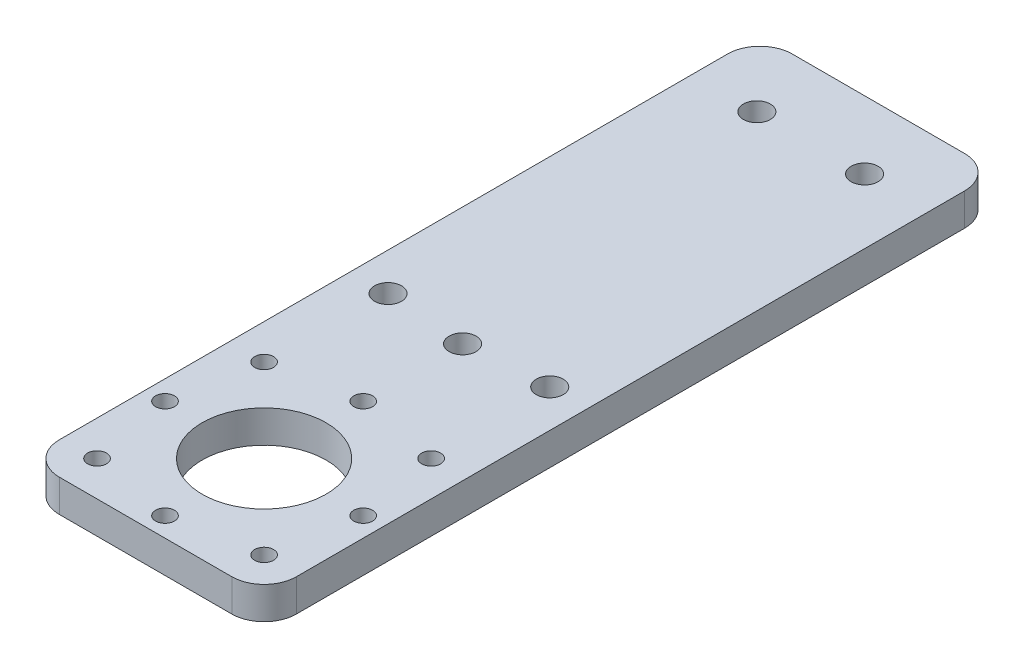
ISO-10303-21;
HEADER;
FILE_DESCRIPTION(('STEP AP214'),'2;1');
FILE_NAME('part.step','',(''),(''),'','','');
FILE_SCHEMA(('AUTOMOTIVE_DESIGN { 1 0 10303 214 1 1 1 1 }'));
ENDSEC;
DATA;
#1=APPLICATION_CONTEXT('core data for automotive mechanical design processes');
#2=APPLICATION_PROTOCOL_DEFINITION('international standard','automotive_design',2000,#1);
#3=PRODUCT_CONTEXT('',#1,'mechanical');
#4=PRODUCT('Part','Part','',(#3));
#5=PRODUCT_RELATED_PRODUCT_CATEGORY('part','',(#4));
#6=PRODUCT_DEFINITION_FORMATION('','',#4);
#7=PRODUCT_DEFINITION_CONTEXT('part definition',#1,'design');
#8=PRODUCT_DEFINITION('design','',#6,#7);
#9=PRODUCT_DEFINITION_SHAPE('','',#8);
#10=(LENGTH_UNIT() NAMED_UNIT(*) SI_UNIT(.MILLI.,.METRE.));
#11=(NAMED_UNIT(*) PLANE_ANGLE_UNIT() SI_UNIT($,.RADIAN.));
#12=(NAMED_UNIT(*) SI_UNIT($,.STERADIAN.) SOLID_ANGLE_UNIT());
#13=UNCERTAINTY_MEASURE_WITH_UNIT(LENGTH_MEASURE(1.E-05),#10,'distance_accuracy_value','');
#14=(GEOMETRIC_REPRESENTATION_CONTEXT(3) GLOBAL_UNCERTAINTY_ASSIGNED_CONTEXT((#13)) GLOBAL_UNIT_ASSIGNED_CONTEXT((#10,
#11,#12)) REPRESENTATION_CONTEXT('',''));
#15=CARTESIAN_POINT('',(0.,0.,0.));
#16=DIRECTION('',(0.,0.,1.));
#17=DIRECTION('',(1.,0.,0.));
#18=AXIS2_PLACEMENT_3D('',#15,#16,#17);
#19=CARTESIAN_POINT('',(0.,0.,0.));
#20=DIRECTION('',(0.,1.,0.));
#21=DIRECTION('',(0.,0.,1.));
#22=AXIS2_PLACEMENT_3D('',#19,#20,#21);
#23=PLANE('',#22);
#24=CARTESIAN_POINT('',(18.38477631085,0.,0.));
#25=DIRECTION('',(0.,-1.,0.));
#26=DIRECTION('',(0.,0.,-1.));
#27=AXIS2_PLACEMENT_3D('',#24,#25,#26);
#28=CIRCLE('',#27,1.75);
#29=CARTESIAN_POINT('',(18.38477631085,0.,-1.75));
#30=VERTEX_POINT('',#29);
#31=EDGE_CURVE('E211',#30,#30,#28,.F.);
#32=ORIENTED_EDGE('',*,*,#31,.T.);
#33=EDGE_LOOP('',(#32));
#34=FACE_BOUND('',#33,.T.);
#35=CARTESIAN_POINT('',(0.,0.,18.38477631085));
#36=DIRECTION('',(0.,-1.,0.));
#37=DIRECTION('',(0.,0.,-1.));
#38=AXIS2_PLACEMENT_3D('',#35,#36,#37);
#39=CIRCLE('',#38,1.75);
#40=CARTESIAN_POINT('',(0.,0.,16.63477631085));
#41=VERTEX_POINT('',#40);
#42=EDGE_CURVE('E215',#41,#41,#39,.F.);
#43=ORIENTED_EDGE('',*,*,#42,.T.);
#44=EDGE_LOOP('',(#43));
#45=FACE_BOUND('',#44,.T.);
#46=CARTESIAN_POINT('',(-18.38477631085,0.,0.));
#47=DIRECTION('',(0.,-1.,0.));
#48=DIRECTION('',(0.,0.,-1.));
#49=AXIS2_PLACEMENT_3D('',#46,#47,#48);
#50=CIRCLE('',#49,1.75);
#51=CARTESIAN_POINT('',(-18.38477631085,0.,-1.75));
#52=VERTEX_POINT('',#51);
#53=EDGE_CURVE('E219',#52,#52,#50,.F.);
#54=ORIENTED_EDGE('',*,*,#53,.T.);
#55=EDGE_LOOP('',(#54));
#56=FACE_BOUND('',#55,.T.);
#57=CARTESIAN_POINT('',(0.,0.,-18.38477631085));
#58=DIRECTION('',(0.,-1.,0.));
#59=DIRECTION('',(0.,0.,-1.));
#60=AXIS2_PLACEMENT_3D('',#57,#58,#59);
#61=CIRCLE('',#60,1.75);
#62=CARTESIAN_POINT('',(0.,0.,-20.13477631085));
#63=VERTEX_POINT('',#62);
#64=EDGE_CURVE('E223',#63,#63,#61,.F.);
#65=ORIENTED_EDGE('',*,*,#64,.T.);
#66=EDGE_LOOP('',(#65));
#67=FACE_BOUND('',#66,.T.);
#68=CARTESIAN_POINT('',(-15.5,0.,15.5));
#69=DIRECTION('',(0.,-1.,0.));
#70=DIRECTION('',(0.,0.,-1.));
#71=AXIS2_PLACEMENT_3D('',#68,#69,#70);
#72=CIRCLE('',#71,1.75);
#73=CARTESIAN_POINT('',(-15.5,0.,13.75));
#74=VERTEX_POINT('',#73);
#75=EDGE_CURVE('E227',#74,#74,#72,.F.);
#76=ORIENTED_EDGE('',*,*,#75,.T.);
#77=EDGE_LOOP('',(#76));
#78=FACE_BOUND('',#77,.T.);
#79=CARTESIAN_POINT('',(-15.5,0.,-15.5));
#80=DIRECTION('',(0.,-1.,0.));
#81=DIRECTION('',(0.,0.,-1.));
#82=AXIS2_PLACEMENT_3D('',#79,#80,#81);
#83=CIRCLE('',#82,1.75);
#84=CARTESIAN_POINT('',(-15.5,0.,-17.25));
#85=VERTEX_POINT('',#84);
#86=EDGE_CURVE('E231',#85,#85,#83,.F.);
#87=ORIENTED_EDGE('',*,*,#86,.T.);
#88=EDGE_LOOP('',(#87));
#89=FACE_BOUND('',#88,.T.);
#90=CARTESIAN_POINT('',(15.5,0.,-15.5));
#91=DIRECTION('',(0.,-1.,0.));
#92=DIRECTION('',(0.,0.,-1.));
#93=AXIS2_PLACEMENT_3D('',#90,#91,#92);
#94=CIRCLE('',#93,1.75);
#95=CARTESIAN_POINT('',(15.5,0.,-17.25));
#96=VERTEX_POINT('',#95);
#97=EDGE_CURVE('E235',#96,#96,#94,.F.);
#98=ORIENTED_EDGE('',*,*,#97,.T.);
#99=EDGE_LOOP('',(#98));
#100=FACE_BOUND('',#99,.T.);
#101=CARTESIAN_POINT('',(15.5,0.,15.5));
#102=DIRECTION('',(0.,-1.,0.));
#103=DIRECTION('',(0.,0.,-1.));
#104=AXIS2_PLACEMENT_3D('',#101,#102,#103);
#105=CIRCLE('',#104,1.75);
#106=CARTESIAN_POINT('',(15.5,0.,13.75));
#107=VERTEX_POINT('',#106);
#108=EDGE_CURVE('E239',#107,#107,#105,.F.);
#109=ORIENTED_EDGE('',*,*,#108,.T.);
#110=EDGE_LOOP('',(#109));
#111=FACE_BOUND('',#110,.T.);
#112=CARTESIAN_POINT('',(15.,0.,-38.));
#113=DIRECTION('',(0.,1.,0.));
#114=DIRECTION('',(0.,0.,1.));
#115=AXIS2_PLACEMENT_3D('',#112,#113,#114);
#116=CIRCLE('',#115,2.5);
#117=CARTESIAN_POINT('',(15.,0.,-35.5));
#118=VERTEX_POINT('',#117);
#119=EDGE_CURVE('E243',#118,#118,#116,.T.);
#120=ORIENTED_EDGE('',*,*,#119,.T.);
#121=EDGE_LOOP('',(#120));
#122=FACE_BOUND('',#121,.T.);
#123=CARTESIAN_POINT('',(-15.,0.,-38.));
#124=DIRECTION('',(0.,1.,0.));
#125=DIRECTION('',(0.,0.,1.));
#126=AXIS2_PLACEMENT_3D('',#123,#124,#125);
#127=CIRCLE('',#126,2.5);
#128=CARTESIAN_POINT('',(-15.,0.,-35.5));
#129=VERTEX_POINT('',#128);
#130=EDGE_CURVE('E247',#129,#129,#127,.T.);
#131=ORIENTED_EDGE('',*,*,#130,.T.);
#132=EDGE_LOOP('',(#131));
#133=FACE_BOUND('',#132,.T.);
#134=CARTESIAN_POINT('',(-10.,0.,-101.43));
#135=DIRECTION('',(0.,-1.,0.));
#136=DIRECTION('',(0.,0.,-1.));
#137=AXIS2_PLACEMENT_3D('',#134,#135,#136);
#138=CIRCLE('',#137,2.5);
#139=CARTESIAN_POINT('',(-10.,0.,-103.93));
#140=VERTEX_POINT('',#139);
#141=EDGE_CURVE('E251',#140,#140,#138,.F.);
#142=ORIENTED_EDGE('',*,*,#141,.T.);
#143=EDGE_LOOP('',(#142));
#144=FACE_BOUND('',#143,.T.);
#145=CARTESIAN_POINT('',(0.,0.,0.));
#146=DIRECTION('',(0.,-1.,0.));
#147=DIRECTION('',(0.,0.,-1.));
#148=AXIS2_PLACEMENT_3D('',#145,#146,#147);
#149=CIRCLE('',#148,11.5);
#150=CARTESIAN_POINT('',(0.,0.,-11.5));
#151=VERTEX_POINT('',#150);
#152=EDGE_CURVE('E255',#151,#151,#149,.F.);
#153=ORIENTED_EDGE('',*,*,#152,.T.);
#154=EDGE_LOOP('',(#153));
#155=FACE_BOUND('',#154,.T.);
#156=CARTESIAN_POINT('',(10.,0.,-101.43));
#157=DIRECTION('',(0.,-1.,0.));
#158=DIRECTION('',(0.,0.,-1.));
#159=AXIS2_PLACEMENT_3D('',#156,#157,#158);
#160=CIRCLE('',#159,2.5);
#161=CARTESIAN_POINT('',(10.,0.,-103.93));
#162=VERTEX_POINT('',#161);
#163=EDGE_CURVE('E259',#162,#162,#160,.F.);
#164=ORIENTED_EDGE('',*,*,#163,.T.);
#165=EDGE_LOOP('',(#164));
#166=FACE_BOUND('',#165,.T.);
#167=CARTESIAN_POINT('',(0.,0.,-36.83));
#168=DIRECTION('',(0.,-1.,0.));
#169=DIRECTION('',(0.,0.,-1.));
#170=AXIS2_PLACEMENT_3D('',#167,#168,#169);
#171=CIRCLE('',#170,2.5);
#172=CARTESIAN_POINT('',(0.,0.,-39.33));
#173=VERTEX_POINT('',#172);
#174=EDGE_CURVE('E262',#173,#173,#171,.F.);
#175=ORIENTED_EDGE('',*,*,#174,.T.);
#176=EDGE_LOOP('',(#175));
#177=FACE_BOUND('',#176,.T.);
#178=CARTESIAN_POINT('',(-16.,0.,16.));
#179=DIRECTION('',(0.,-1.,0.));
#180=DIRECTION('',(0.,0.,-1.));
#181=AXIS2_PLACEMENT_3D('',#178,#179,#180);
#182=CIRCLE('',#181,6.);
#183=CARTESIAN_POINT('',(-22.,0.,16.));
#184=VERTEX_POINT('',#183);
#185=CARTESIAN_POINT('',(-16.,0.,22.));
#186=VERTEX_POINT('',#185);
#187=EDGE_CURVE('E270',#184,#186,#182,.F.);
#188=ORIENTED_EDGE('',*,*,#187,.F.);
#189=DIRECTION('',(0.,0.,1.));
#190=VECTOR('',#189,1.);
#191=CARTESIAN_POINT('',(-22.,0.,-114.));
#192=LINE('',#191,#190);
#193=CARTESIAN_POINT('',(-22.,0.,-108.));
#194=VERTEX_POINT('',#193);
#195=EDGE_CURVE('E138',#194,#184,#192,.T.);
#196=ORIENTED_EDGE('',*,*,#195,.F.);
#197=CARTESIAN_POINT('',(-16.,0.,-108.));
#198=DIRECTION('',(0.,-1.,0.));
#199=DIRECTION('',(0.,0.,-1.));
#200=AXIS2_PLACEMENT_3D('',#197,#198,#199);
#201=CIRCLE('',#200,6.);
#202=CARTESIAN_POINT('',(-16.,0.,-114.));
#203=VERTEX_POINT('',#202);
#204=EDGE_CURVE('E104',#203,#194,#201,.F.);
#205=ORIENTED_EDGE('',*,*,#204,.F.);
#206=DIRECTION('',(-1.,0.,0.));
#207=VECTOR('',#206,1.);
#208=CARTESIAN_POINT('',(22.,0.,-114.));
#209=LINE('',#208,#207);
#210=CARTESIAN_POINT('',(16.,0.,-114.));
#211=VERTEX_POINT('',#210);
#212=EDGE_CURVE('E99',#211,#203,#209,.T.);
#213=ORIENTED_EDGE('',*,*,#212,.F.);
#214=CARTESIAN_POINT('',(16.,0.,-108.));
#215=DIRECTION('',(0.,-1.,0.));
#216=DIRECTION('',(0.,0.,-1.));
#217=AXIS2_PLACEMENT_3D('',#214,#215,#216);
#218=CIRCLE('',#217,6.);
#219=CARTESIAN_POINT('',(22.,0.,-108.));
#220=VERTEX_POINT('',#219);
#221=EDGE_CURVE('E20',#220,#211,#218,.F.);
#222=ORIENTED_EDGE('',*,*,#221,.F.);
#223=DIRECTION('',(0.,0.,-1.));
#224=VECTOR('',#223,1.);
#225=CARTESIAN_POINT('',(22.,0.,22.));
#226=LINE('',#225,#224);
#227=CARTESIAN_POINT('',(22.,0.,16.));
#228=VERTEX_POINT('',#227);
#229=EDGE_CURVE('E93',#228,#220,#226,.T.);
#230=ORIENTED_EDGE('',*,*,#229,.F.);
#231=CARTESIAN_POINT('',(16.,0.,16.));
#232=DIRECTION('',(0.,-1.,0.));
#233=DIRECTION('',(0.,0.,-1.));
#234=AXIS2_PLACEMENT_3D('',#231,#232,#233);
#235=CIRCLE('',#234,6.);
#236=CARTESIAN_POINT('',(16.,0.,22.));
#237=VERTEX_POINT('',#236);
#238=EDGE_CURVE('E266',#237,#228,#235,.F.);
#239=ORIENTED_EDGE('',*,*,#238,.F.);
#240=DIRECTION('',(1.,0.,0.));
#241=VECTOR('',#240,1.);
#242=CARTESIAN_POINT('',(-22.,0.,22.));
#243=LINE('',#242,#241);
#244=EDGE_CURVE('E131',#186,#237,#243,.T.);
#245=ORIENTED_EDGE('',*,*,#244,.F.);
#246=EDGE_LOOP('',(#188,#196,#205,#213,#222,#230,#239,#245));
#247=FACE_BOUND('',#246,.T.);
#248=ADVANCED_FACE('F17',(#34,#45,#56,#67,#78,#89,#100,#111,#122,#133,#144,#155,#166,#177,#247),
#23,.F.);
#249=CARTESIAN_POINT('',(22.,0.,22.));
#250=DIRECTION('',(1.,0.,0.));
#251=DIRECTION('',(0.,0.,-1.));
#252=AXIS2_PLACEMENT_3D('',#249,#250,#251);
#253=PLANE('',#252);
#254=DIRECTION('',(0.,0.,1.));
#255=VECTOR('',#254,1.);
#256=CARTESIAN_POINT('',(22.,6.,0.));
#257=LINE('',#256,#255);
#258=CARTESIAN_POINT('',(22.,6.,16.));
#259=VERTEX_POINT('',#258);
#260=CARTESIAN_POINT('',(22.,6.,-108.));
#261=VERTEX_POINT('',#260);
#262=EDGE_CURVE('E210',#259,#261,#257,.F.);
#263=ORIENTED_EDGE('',*,*,#262,.F.);
#264=DIRECTION('',(0.,-1.,0.));
#265=VECTOR('',#264,1.);
#266=CARTESIAN_POINT('',(22.,13.8216,16.));
#267=LINE('',#266,#265);
#268=EDGE_CURVE('E134',#228,#259,#267,.F.);
#269=ORIENTED_EDGE('',*,*,#268,.F.);
#270=ORIENTED_EDGE('',*,*,#229,.T.);
#271=DIRECTION('',(0.,-1.,0.));
#272=VECTOR('',#271,1.);
#273=CARTESIAN_POINT('',(22.,13.8216,-108.));
#274=LINE('',#273,#272);
#275=EDGE_CURVE('E115',#261,#220,#274,.T.);
#276=ORIENTED_EDGE('',*,*,#275,.F.);
#277=EDGE_LOOP('',(#263,#269,#270,#276));
#278=FACE_BOUND('',#277,.T.);
#279=ADVANCED_FACE('F309',(#278),#253,.T.);
#280=CARTESIAN_POINT('',(16.,13.8216,-108.));
#281=DIRECTION('',(0.,-1.,0.));
#282=DIRECTION('',(0.,0.,-1.));
#283=AXIS2_PLACEMENT_3D('',#280,#281,#282);
#284=CYLINDRICAL_SURFACE('',#283,6.);
#285=ORIENTED_EDGE('',*,*,#275,.T.);
#286=ORIENTED_EDGE('',*,*,#221,.T.);
#287=DIRECTION('',(0.,1.,0.));
#288=VECTOR('',#287,1.);
#289=CARTESIAN_POINT('',(16.,0.,-114.));
#290=LINE('',#289,#288);
#291=CARTESIAN_POINT('',(16.,6.,-114.));
#292=VERTEX_POINT('',#291);
#293=EDGE_CURVE('E109',#292,#211,#290,.F.);
#294=ORIENTED_EDGE('',*,*,#293,.F.);
#295=CARTESIAN_POINT('',(16.,6.,-108.));
#296=DIRECTION('',(0.,-1.,0.));
#297=DIRECTION('',(0.,0.,-1.));
#298=AXIS2_PLACEMENT_3D('',#295,#296,#297);
#299=CIRCLE('',#298,6.);
#300=EDGE_CURVE('E207',#261,#292,#299,.F.);
#301=ORIENTED_EDGE('',*,*,#300,.F.);
#302=EDGE_LOOP('',(#285,#286,#294,#301));
#303=FACE_BOUND('',#302,.T.);
#304=ADVANCED_FACE('F112',(#303),#284,.T.);
#305=CARTESIAN_POINT('',(22.,0.,-114.));
#306=DIRECTION('',(0.,0.,-1.));
#307=DIRECTION('',(-1.,0.,0.));
#308=AXIS2_PLACEMENT_3D('',#305,#306,#307);
#309=PLANE('',#308);
#310=DIRECTION('',(1.,0.,0.));
#311=VECTOR('',#310,1.);
#312=CARTESIAN_POINT('',(0.,6.,-114.));
#313=LINE('',#312,#311);
#314=CARTESIAN_POINT('',(-16.,6.,-114.));
#315=VERTEX_POINT('',#314);
#316=EDGE_CURVE('E119',#292,#315,#313,.F.);
#317=ORIENTED_EDGE('',*,*,#316,.F.);
#318=ORIENTED_EDGE('',*,*,#293,.T.);
#319=ORIENTED_EDGE('',*,*,#212,.T.);
#320=DIRECTION('',(0.,-1.,0.));
#321=VECTOR('',#320,1.);
#322=CARTESIAN_POINT('',(-16.,13.8216,-114.));
#323=LINE('',#322,#321);
#324=EDGE_CURVE('E122',#315,#203,#323,.T.);
#325=ORIENTED_EDGE('',*,*,#324,.F.);
#326=EDGE_LOOP('',(#317,#318,#319,#325));
#327=FACE_BOUND('',#326,.T.);
#328=ADVANCED_FACE('F117',(#327),#309,.T.);
#329=CARTESIAN_POINT('',(-16.,13.8216,-108.));
#330=DIRECTION('',(0.,-1.,0.));
#331=DIRECTION('',(0.,0.,-1.));
#332=AXIS2_PLACEMENT_3D('',#329,#330,#331);
#333=CYLINDRICAL_SURFACE('',#332,6.);
#334=ORIENTED_EDGE('',*,*,#324,.T.);
#335=ORIENTED_EDGE('',*,*,#204,.T.);
#336=DIRECTION('',(0.,1.,0.));
#337=VECTOR('',#336,1.);
#338=CARTESIAN_POINT('',(-22.,0.,-108.));
#339=LINE('',#338,#337);
#340=CARTESIAN_POINT('',(-22.,6.,-108.));
#341=VERTEX_POINT('',#340);
#342=EDGE_CURVE('E141',#341,#194,#339,.F.);
#343=ORIENTED_EDGE('',*,*,#342,.F.);
#344=CARTESIAN_POINT('',(-16.,6.,-108.));
#345=DIRECTION('',(0.,-1.,0.));
#346=DIRECTION('',(0.,0.,-1.));
#347=AXIS2_PLACEMENT_3D('',#344,#345,#346);
#348=CIRCLE('',#347,6.);
#349=EDGE_CURVE('E203',#315,#341,#348,.F.);
#350=ORIENTED_EDGE('',*,*,#349,.F.);
#351=EDGE_LOOP('',(#334,#335,#343,#350));
#352=FACE_BOUND('',#351,.T.);
#353=ADVANCED_FACE('F311',(#352),#333,.T.);
#354=CARTESIAN_POINT('',(-22.,0.,-114.));
#355=DIRECTION('',(-1.,0.,0.));
#356=DIRECTION('',(0.,0.,1.));
#357=AXIS2_PLACEMENT_3D('',#354,#355,#356);
#358=PLANE('',#357);
#359=ORIENTED_EDGE('',*,*,#195,.T.);
#360=DIRECTION('',(0.,-1.,0.));
#361=VECTOR('',#360,1.);
#362=CARTESIAN_POINT('',(-22.,13.8216,16.));
#363=LINE('',#362,#361);
#364=CARTESIAN_POINT('',(-22.,6.,16.));
#365=VERTEX_POINT('',#364);
#366=EDGE_CURVE('E140',#365,#184,#363,.T.);
#367=ORIENTED_EDGE('',*,*,#366,.F.);
#368=DIRECTION('',(0.,0.,1.));
#369=VECTOR('',#368,1.);
#370=CARTESIAN_POINT('',(-22.,6.,0.));
#371=LINE('',#370,#369);
#372=EDGE_CURVE('E202',#341,#365,#371,.T.);
#373=ORIENTED_EDGE('',*,*,#372,.F.);
#374=ORIENTED_EDGE('',*,*,#342,.T.);
#375=EDGE_LOOP('',(#359,#367,#373,#374));
#376=FACE_BOUND('',#375,.T.);
#377=ADVANCED_FACE('F312',(#376),#358,.T.);
#378=CARTESIAN_POINT('',(-16.,13.8216,16.));
#379=DIRECTION('',(0.,-1.,0.));
#380=DIRECTION('',(0.,0.,-1.));
#381=AXIS2_PLACEMENT_3D('',#378,#379,#380);
#382=CYLINDRICAL_SURFACE('',#381,6.);
#383=ORIENTED_EDGE('',*,*,#366,.T.);
#384=ORIENTED_EDGE('',*,*,#187,.T.);
#385=DIRECTION('',(0.,1.,0.));
#386=VECTOR('',#385,1.);
#387=CARTESIAN_POINT('',(-16.,0.,22.));
#388=LINE('',#387,#386);
#389=CARTESIAN_POINT('',(-16.,6.,22.));
#390=VERTEX_POINT('',#389);
#391=EDGE_CURVE('E135',#390,#186,#388,.F.);
#392=ORIENTED_EDGE('',*,*,#391,.F.);
#393=CARTESIAN_POINT('',(-16.,6.,16.));
#394=DIRECTION('',(0.,-1.,0.));
#395=DIRECTION('',(0.,0.,-1.));
#396=AXIS2_PLACEMENT_3D('',#393,#394,#395);
#397=CIRCLE('',#396,6.);
#398=EDGE_CURVE('E198',#365,#390,#397,.F.);
#399=ORIENTED_EDGE('',*,*,#398,.F.);
#400=EDGE_LOOP('',(#383,#384,#392,#399));
#401=FACE_BOUND('',#400,.T.);
#402=ADVANCED_FACE('F306',(#401),#382,.T.);
#403=CARTESIAN_POINT('',(-22.,0.,22.));
#404=DIRECTION('',(0.,0.,1.));
#405=DIRECTION('',(1.,0.,0.));
#406=AXIS2_PLACEMENT_3D('',#403,#404,#405);
#407=PLANE('',#406);
#408=ORIENTED_EDGE('',*,*,#244,.T.);
#409=DIRECTION('',(0.,-1.,0.));
#410=VECTOR('',#409,1.);
#411=CARTESIAN_POINT('',(16.,13.8216,22.));
#412=LINE('',#411,#410);
#413=CARTESIAN_POINT('',(16.,6.,22.));
#414=VERTEX_POINT('',#413);
#415=EDGE_CURVE('E40',#414,#237,#412,.T.);
#416=ORIENTED_EDGE('',*,*,#415,.F.);
#417=DIRECTION('',(1.,0.,0.));
#418=VECTOR('',#417,1.);
#419=CARTESIAN_POINT('',(0.,6.,22.));
#420=LINE('',#419,#418);
#421=EDGE_CURVE('E197',#390,#414,#420,.T.);
#422=ORIENTED_EDGE('',*,*,#421,.F.);
#423=ORIENTED_EDGE('',*,*,#391,.T.);
#424=EDGE_LOOP('',(#408,#416,#422,#423));
#425=FACE_BOUND('',#424,.T.);
#426=ADVANCED_FACE('F302',(#425),#407,.T.);
#427=CARTESIAN_POINT('',(16.,13.8216,16.));
#428=DIRECTION('',(0.,-1.,0.));
#429=DIRECTION('',(0.,0.,-1.));
#430=AXIS2_PLACEMENT_3D('',#427,#428,#429);
#431=CYLINDRICAL_SURFACE('',#430,6.);
#432=ORIENTED_EDGE('',*,*,#415,.T.);
#433=ORIENTED_EDGE('',*,*,#238,.T.);
#434=ORIENTED_EDGE('',*,*,#268,.T.);
#435=CARTESIAN_POINT('',(16.,6.,16.));
#436=DIRECTION('',(0.,-1.,0.));
#437=DIRECTION('',(0.,0.,-1.));
#438=AXIS2_PLACEMENT_3D('',#435,#436,#437);
#439=CIRCLE('',#438,6.);
#440=EDGE_CURVE('E193',#414,#259,#439,.F.);
#441=ORIENTED_EDGE('',*,*,#440,.F.);
#442=EDGE_LOOP('',(#432,#433,#434,#441));
#443=FACE_BOUND('',#442,.T.);
#444=ADVANCED_FACE('F308',(#443),#431,.T.);
#445=CARTESIAN_POINT('',(0.,6.,-36.83));
#446=DIRECTION('',(0.,-1.,0.));
#447=DIRECTION('',(0.,0.,-1.));
#448=AXIS2_PLACEMENT_3D('',#445,#446,#447);
#449=CYLINDRICAL_SURFACE('',#448,2.5);
#450=CARTESIAN_POINT('',(0.,6.,-36.83));
#451=DIRECTION('',(0.,-1.,0.));
#452=DIRECTION('',(0.,0.,-1.));
#453=AXIS2_PLACEMENT_3D('',#450,#451,#452);
#454=CIRCLE('',#453,2.5);
#455=CARTESIAN_POINT('',(0.,6.,-39.33));
#456=VERTEX_POINT('',#455);
#457=EDGE_CURVE('E189',#456,#456,#454,.T.);
#458=ORIENTED_EDGE('',*,*,#457,.F.);
#459=EDGE_LOOP('',(#458));
#460=FACE_BOUND('',#459,.T.);
#461=ORIENTED_EDGE('',*,*,#174,.F.);
#462=EDGE_LOOP('',(#461));
#463=FACE_BOUND('',#462,.T.);
#464=ADVANCED_FACE('F380',(#460,#463),#449,.F.);
#465=CARTESIAN_POINT('',(10.,6.,-101.43));
#466=DIRECTION('',(0.,-1.,0.));
#467=DIRECTION('',(0.,0.,-1.));
#468=AXIS2_PLACEMENT_3D('',#465,#466,#467);
#469=CYLINDRICAL_SURFACE('',#468,2.5);
#470=CARTESIAN_POINT('',(10.,6.,-101.43));
#471=DIRECTION('',(0.,-1.,0.));
#472=DIRECTION('',(0.,0.,-1.));
#473=AXIS2_PLACEMENT_3D('',#470,#471,#472);
#474=CIRCLE('',#473,2.5);
#475=CARTESIAN_POINT('',(10.,6.,-103.93));
#476=VERTEX_POINT('',#475);
#477=EDGE_CURVE('E186',#476,#476,#474,.T.);
#478=ORIENTED_EDGE('',*,*,#477,.F.);
#479=EDGE_LOOP('',(#478));
#480=FACE_BOUND('',#479,.T.);
#481=ORIENTED_EDGE('',*,*,#163,.F.);
#482=EDGE_LOOP('',(#481));
#483=FACE_BOUND('',#482,.T.);
#484=ADVANCED_FACE('F376',(#480,#483),#469,.F.);
#485=CARTESIAN_POINT('',(0.,6.,0.));
#486=DIRECTION('',(0.,-1.,0.));
#487=DIRECTION('',(0.,0.,-1.));
#488=AXIS2_PLACEMENT_3D('',#485,#486,#487);
#489=CYLINDRICAL_SURFACE('',#488,11.5);
#490=CARTESIAN_POINT('',(0.,6.,0.));
#491=DIRECTION('',(0.,-1.,0.));
#492=DIRECTION('',(0.,0.,-1.));
#493=AXIS2_PLACEMENT_3D('',#490,#491,#492);
#494=CIRCLE('',#493,11.5);
#495=CARTESIAN_POINT('',(0.,6.,-11.5));
#496=VERTEX_POINT('',#495);
#497=EDGE_CURVE('E182',#496,#496,#494,.T.);
#498=ORIENTED_EDGE('',*,*,#497,.F.);
#499=EDGE_LOOP('',(#498));
#500=FACE_BOUND('',#499,.T.);
#501=ORIENTED_EDGE('',*,*,#152,.F.);
#502=EDGE_LOOP('',(#501));
#503=FACE_BOUND('',#502,.T.);
#504=ADVANCED_FACE('F372',(#500,#503),#489,.F.);
#505=CARTESIAN_POINT('',(-10.,6.,-101.43));
#506=DIRECTION('',(0.,-1.,0.));
#507=DIRECTION('',(0.,0.,-1.));
#508=AXIS2_PLACEMENT_3D('',#505,#506,#507);
#509=CYLINDRICAL_SURFACE('',#508,2.5);
#510=CARTESIAN_POINT('',(-10.,6.,-101.43));
#511=DIRECTION('',(0.,-1.,0.));
#512=DIRECTION('',(0.,0.,-1.));
#513=AXIS2_PLACEMENT_3D('',#510,#511,#512);
#514=CIRCLE('',#513,2.5);
#515=CARTESIAN_POINT('',(-10.,6.,-103.93));
#516=VERTEX_POINT('',#515);
#517=EDGE_CURVE('E178',#516,#516,#514,.T.);
#518=ORIENTED_EDGE('',*,*,#517,.F.);
#519=EDGE_LOOP('',(#518));
#520=FACE_BOUND('',#519,.T.);
#521=ORIENTED_EDGE('',*,*,#141,.F.);
#522=EDGE_LOOP('',(#521));
#523=FACE_BOUND('',#522,.T.);
#524=ADVANCED_FACE('F368',(#520,#523),#509,.F.);
#525=CARTESIAN_POINT('',(-15.,0.,-38.));
#526=DIRECTION('',(0.,1.,0.));
#527=DIRECTION('',(0.,0.,1.));
#528=AXIS2_PLACEMENT_3D('',#525,#526,#527);
#529=CYLINDRICAL_SURFACE('',#528,2.5);
#530=CARTESIAN_POINT('',(-15.,6.,-38.));
#531=DIRECTION('',(0.,1.,0.));
#532=DIRECTION('',(0.,0.,1.));
#533=AXIS2_PLACEMENT_3D('',#530,#531,#532);
#534=CIRCLE('',#533,2.5);
#535=CARTESIAN_POINT('',(-15.,6.,-35.5));
#536=VERTEX_POINT('',#535);
#537=EDGE_CURVE('E174',#536,#536,#534,.F.);
#538=ORIENTED_EDGE('',*,*,#537,.F.);
#539=EDGE_LOOP('',(#538));
#540=FACE_BOUND('',#539,.T.);
#541=ORIENTED_EDGE('',*,*,#130,.F.);
#542=EDGE_LOOP('',(#541));
#543=FACE_BOUND('',#542,.T.);
#544=ADVANCED_FACE('F365',(#540,#543),#529,.F.);
#545=CARTESIAN_POINT('',(15.,0.,-38.));
#546=DIRECTION('',(0.,1.,0.));
#547=DIRECTION('',(0.,0.,1.));
#548=AXIS2_PLACEMENT_3D('',#545,#546,#547);
#549=CYLINDRICAL_SURFACE('',#548,2.5);
#550=CARTESIAN_POINT('',(15.,6.,-38.));
#551=DIRECTION('',(0.,1.,0.));
#552=DIRECTION('',(0.,0.,1.));
#553=AXIS2_PLACEMENT_3D('',#550,#551,#552);
#554=CIRCLE('',#553,2.5);
#555=CARTESIAN_POINT('',(15.,6.,-35.5));
#556=VERTEX_POINT('',#555);
#557=EDGE_CURVE('E170',#556,#556,#554,.F.);
#558=ORIENTED_EDGE('',*,*,#557,.F.);
#559=EDGE_LOOP('',(#558));
#560=FACE_BOUND('',#559,.T.);
#561=ORIENTED_EDGE('',*,*,#119,.F.);
#562=EDGE_LOOP('',(#561));
#563=FACE_BOUND('',#562,.T.);
#564=ADVANCED_FACE('F361',(#560,#563),#549,.F.);
#565=CARTESIAN_POINT('',(15.5,6.,15.5));
#566=DIRECTION('',(0.,-1.,0.));
#567=DIRECTION('',(0.,0.,-1.));
#568=AXIS2_PLACEMENT_3D('',#565,#566,#567);
#569=CYLINDRICAL_SURFACE('',#568,1.75);
#570=CARTESIAN_POINT('',(15.5,6.,15.5));
#571=DIRECTION('',(0.,-1.,0.));
#572=DIRECTION('',(0.,0.,-1.));
#573=AXIS2_PLACEMENT_3D('',#570,#571,#572);
#574=CIRCLE('',#573,1.75);
#575=CARTESIAN_POINT('',(15.5,6.,13.75));
#576=VERTEX_POINT('',#575);
#577=EDGE_CURVE('E166',#576,#576,#574,.T.);
#578=ORIENTED_EDGE('',*,*,#577,.F.);
#579=EDGE_LOOP('',(#578));
#580=FACE_BOUND('',#579,.T.);
#581=ORIENTED_EDGE('',*,*,#108,.F.);
#582=EDGE_LOOP('',(#581));
#583=FACE_BOUND('',#582,.T.);
#584=ADVANCED_FACE('F357',(#580,#583),#569,.F.);
#585=CARTESIAN_POINT('',(15.5,6.,-15.5));
#586=DIRECTION('',(0.,-1.,0.));
#587=DIRECTION('',(0.,0.,-1.));
#588=AXIS2_PLACEMENT_3D('',#585,#586,#587);
#589=CYLINDRICAL_SURFACE('',#588,1.75);
#590=CARTESIAN_POINT('',(15.5,6.,-15.5));
#591=DIRECTION('',(0.,-1.,0.));
#592=DIRECTION('',(0.,0.,-1.));
#593=AXIS2_PLACEMENT_3D('',#590,#591,#592);
#594=CIRCLE('',#593,1.75);
#595=CARTESIAN_POINT('',(15.5,6.,-17.25));
#596=VERTEX_POINT('',#595);
#597=EDGE_CURVE('E162',#596,#596,#594,.T.);
#598=ORIENTED_EDGE('',*,*,#597,.F.);
#599=EDGE_LOOP('',(#598));
#600=FACE_BOUND('',#599,.T.);
#601=ORIENTED_EDGE('',*,*,#97,.F.);
#602=EDGE_LOOP('',(#601));
#603=FACE_BOUND('',#602,.T.);
#604=ADVANCED_FACE('F353',(#600,#603),#589,.F.);
#605=CARTESIAN_POINT('',(-15.5,6.,-15.5));
#606=DIRECTION('',(0.,-1.,0.));
#607=DIRECTION('',(0.,0.,-1.));
#608=AXIS2_PLACEMENT_3D('',#605,#606,#607);
#609=CYLINDRICAL_SURFACE('',#608,1.75);
#610=CARTESIAN_POINT('',(-15.5,6.,-15.5));
#611=DIRECTION('',(0.,-1.,0.));
#612=DIRECTION('',(0.,0.,-1.));
#613=AXIS2_PLACEMENT_3D('',#610,#611,#612);
#614=CIRCLE('',#613,1.75);
#615=CARTESIAN_POINT('',(-15.5,6.,-17.25));
#616=VERTEX_POINT('',#615);
#617=EDGE_CURVE('E158',#616,#616,#614,.T.);
#618=ORIENTED_EDGE('',*,*,#617,.F.);
#619=EDGE_LOOP('',(#618));
#620=FACE_BOUND('',#619,.T.);
#621=ORIENTED_EDGE('',*,*,#86,.F.);
#622=EDGE_LOOP('',(#621));
#623=FACE_BOUND('',#622,.T.);
#624=ADVANCED_FACE('F349',(#620,#623),#609,.F.);
#625=CARTESIAN_POINT('',(-15.5,6.,15.5));
#626=DIRECTION('',(0.,-1.,0.));
#627=DIRECTION('',(0.,0.,-1.));
#628=AXIS2_PLACEMENT_3D('',#625,#626,#627);
#629=CYLINDRICAL_SURFACE('',#628,1.75);
#630=CARTESIAN_POINT('',(-15.5,6.,15.5));
#631=DIRECTION('',(0.,-1.,0.));
#632=DIRECTION('',(0.,0.,-1.));
#633=AXIS2_PLACEMENT_3D('',#630,#631,#632);
#634=CIRCLE('',#633,1.75);
#635=CARTESIAN_POINT('',(-15.5,6.,13.75));
#636=VERTEX_POINT('',#635);
#637=EDGE_CURVE('E154',#636,#636,#634,.T.);
#638=ORIENTED_EDGE('',*,*,#637,.F.);
#639=EDGE_LOOP('',(#638));
#640=FACE_BOUND('',#639,.T.);
#641=ORIENTED_EDGE('',*,*,#75,.F.);
#642=EDGE_LOOP('',(#641));
#643=FACE_BOUND('',#642,.T.);
#644=ADVANCED_FACE('F345',(#640,#643),#629,.F.);
#645=CARTESIAN_POINT('',(0.,6.,-18.38477631085));
#646=DIRECTION('',(0.,-1.,0.));
#647=DIRECTION('',(0.,0.,-1.));
#648=AXIS2_PLACEMENT_3D('',#645,#646,#647);
#649=CYLINDRICAL_SURFACE('',#648,1.75);
#650=CARTESIAN_POINT('',(0.,6.,-18.38477631085));
#651=DIRECTION('',(0.,-1.,0.));
#652=DIRECTION('',(0.,0.,-1.));
#653=AXIS2_PLACEMENT_3D('',#650,#651,#652);
#654=CIRCLE('',#653,1.75);
#655=CARTESIAN_POINT('',(0.,6.,-20.13477631085));
#656=VERTEX_POINT('',#655);
#657=EDGE_CURVE('E150',#656,#656,#654,.T.);
#658=ORIENTED_EDGE('',*,*,#657,.F.);
#659=EDGE_LOOP('',(#658));
#660=FACE_BOUND('',#659,.T.);
#661=ORIENTED_EDGE('',*,*,#64,.F.);
#662=EDGE_LOOP('',(#661));
#663=FACE_BOUND('',#662,.T.);
#664=ADVANCED_FACE('F341',(#660,#663),#649,.F.);
#665=CARTESIAN_POINT('',(-18.38477631085,6.,0.));
#666=DIRECTION('',(0.,-1.,0.));
#667=DIRECTION('',(0.,0.,-1.));
#668=AXIS2_PLACEMENT_3D('',#665,#666,#667);
#669=CYLINDRICAL_SURFACE('',#668,1.75);
#670=CARTESIAN_POINT('',(-18.38477631085,6.,0.));
#671=DIRECTION('',(0.,-1.,0.));
#672=DIRECTION('',(0.,0.,-1.));
#673=AXIS2_PLACEMENT_3D('',#670,#671,#672);
#674=CIRCLE('',#673,1.75);
#675=CARTESIAN_POINT('',(-18.38477631085,6.,-1.75));
#676=VERTEX_POINT('',#675);
#677=EDGE_CURVE('E146',#676,#676,#674,.T.);
#678=ORIENTED_EDGE('',*,*,#677,.F.);
#679=EDGE_LOOP('',(#678));
#680=FACE_BOUND('',#679,.T.);
#681=ORIENTED_EDGE('',*,*,#53,.F.);
#682=EDGE_LOOP('',(#681));
#683=FACE_BOUND('',#682,.T.);
#684=ADVANCED_FACE('F337',(#680,#683),#669,.F.);
#685=CARTESIAN_POINT('',(0.,6.,18.38477631085));
#686=DIRECTION('',(0.,-1.,0.));
#687=DIRECTION('',(0.,0.,-1.));
#688=AXIS2_PLACEMENT_3D('',#685,#686,#687);
#689=CYLINDRICAL_SURFACE('',#688,1.75);
#690=CARTESIAN_POINT('',(0.,6.,18.38477631085));
#691=DIRECTION('',(0.,-1.,0.));
#692=DIRECTION('',(0.,0.,-1.));
#693=AXIS2_PLACEMENT_3D('',#690,#691,#692);
#694=CIRCLE('',#693,1.75);
#695=CARTESIAN_POINT('',(0.,6.,16.63477631085));
#696=VERTEX_POINT('',#695);
#697=EDGE_CURVE('E27',#696,#696,#694,.T.);
#698=ORIENTED_EDGE('',*,*,#697,.F.);
#699=EDGE_LOOP('',(#698));
#700=FACE_BOUND('',#699,.T.);
#701=ORIENTED_EDGE('',*,*,#42,.F.);
#702=EDGE_LOOP('',(#701));
#703=FACE_BOUND('',#702,.T.);
#704=ADVANCED_FACE('F330',(#700,#703),#689,.F.);
#705=CARTESIAN_POINT('',(18.38477631085,6.,0.));
#706=DIRECTION('',(0.,-1.,0.));
#707=DIRECTION('',(0.,0.,-1.));
#708=AXIS2_PLACEMENT_3D('',#705,#706,#707);
#709=CYLINDRICAL_SURFACE('',#708,1.75);
#710=CARTESIAN_POINT('',(18.38477631085,6.,0.));
#711=DIRECTION('',(0.,-1.,0.));
#712=DIRECTION('',(0.,0.,-1.));
#713=AXIS2_PLACEMENT_3D('',#710,#711,#712);
#714=CIRCLE('',#713,1.75);
#715=CARTESIAN_POINT('',(18.38477631085,6.,-1.75));
#716=VERTEX_POINT('',#715);
#717=EDGE_CURVE('E11',#716,#716,#714,.T.);
#718=ORIENTED_EDGE('',*,*,#717,.F.);
#719=EDGE_LOOP('',(#718));
#720=FACE_BOUND('',#719,.T.);
#721=ORIENTED_EDGE('',*,*,#31,.F.);
#722=EDGE_LOOP('',(#721));
#723=FACE_BOUND('',#722,.T.);
#724=ADVANCED_FACE('F324',(#720,#723),#709,.F.);
#725=CARTESIAN_POINT('',(0.,6.,0.));
#726=DIRECTION('',(0.,1.,0.));
#727=DIRECTION('',(0.,0.,1.));
#728=AXIS2_PLACEMENT_3D('',#725,#726,#727);
#729=PLANE('',#728);
#730=ORIENTED_EDGE('',*,*,#717,.T.);
#731=EDGE_LOOP('',(#730));
#732=FACE_BOUND('',#731,.T.);
#733=ORIENTED_EDGE('',*,*,#697,.T.);
#734=EDGE_LOOP('',(#733));
#735=FACE_BOUND('',#734,.T.);
#736=ORIENTED_EDGE('',*,*,#677,.T.);
#737=EDGE_LOOP('',(#736));
#738=FACE_BOUND('',#737,.T.);
#739=ORIENTED_EDGE('',*,*,#657,.T.);
#740=EDGE_LOOP('',(#739));
#741=FACE_BOUND('',#740,.T.);
#742=ORIENTED_EDGE('',*,*,#637,.T.);
#743=EDGE_LOOP('',(#742));
#744=FACE_BOUND('',#743,.T.);
#745=ORIENTED_EDGE('',*,*,#617,.T.);
#746=EDGE_LOOP('',(#745));
#747=FACE_BOUND('',#746,.T.);
#748=ORIENTED_EDGE('',*,*,#597,.T.);
#749=EDGE_LOOP('',(#748));
#750=FACE_BOUND('',#749,.T.);
#751=ORIENTED_EDGE('',*,*,#577,.T.);
#752=EDGE_LOOP('',(#751));
#753=FACE_BOUND('',#752,.T.);
#754=ORIENTED_EDGE('',*,*,#557,.T.);
#755=EDGE_LOOP('',(#754));
#756=FACE_BOUND('',#755,.T.);
#757=ORIENTED_EDGE('',*,*,#537,.T.);
#758=EDGE_LOOP('',(#757));
#759=FACE_BOUND('',#758,.T.);
#760=ORIENTED_EDGE('',*,*,#517,.T.);
#761=EDGE_LOOP('',(#760));
#762=FACE_BOUND('',#761,.T.);
#763=ORIENTED_EDGE('',*,*,#497,.T.);
#764=EDGE_LOOP('',(#763));
#765=FACE_BOUND('',#764,.T.);
#766=ORIENTED_EDGE('',*,*,#477,.T.);
#767=EDGE_LOOP('',(#766));
#768=FACE_BOUND('',#767,.T.);
#769=ORIENTED_EDGE('',*,*,#457,.T.);
#770=EDGE_LOOP('',(#769));
#771=FACE_BOUND('',#770,.T.);
#772=ORIENTED_EDGE('',*,*,#421,.T.);
#773=ORIENTED_EDGE('',*,*,#440,.T.);
#774=ORIENTED_EDGE('',*,*,#262,.T.);
#775=ORIENTED_EDGE('',*,*,#300,.T.);
#776=ORIENTED_EDGE('',*,*,#316,.T.);
#777=ORIENTED_EDGE('',*,*,#349,.T.);
#778=ORIENTED_EDGE('',*,*,#372,.T.);
#779=ORIENTED_EDGE('',*,*,#398,.T.);
#780=EDGE_LOOP('',(#772,#773,#774,#775,#776,#777,#778,#779));
#781=FACE_BOUND('',#780,.T.);
#782=ADVANCED_FACE('F300',(#732,#735,#738,#741,#744,#747,#750,#753,#756,#759,#762,#765,#768,
#771,#781),#729,.T.);
#783=CLOSED_SHELL('',(#248,#279,#304,#328,#353,#377,#402,#426,#444,#464,#484,#504,#524,#544,
#564,#584,#604,#624,#644,#664,#684,#704,#724,#782));
#784=MANIFOLD_SOLID_BREP('B1',#783);
#785=ADVANCED_BREP_SHAPE_REPRESENTATION('',(#18,#784),#14);
#786=SHAPE_DEFINITION_REPRESENTATION(#9,#785);
ENDSEC;
END-ISO-10303-21;
